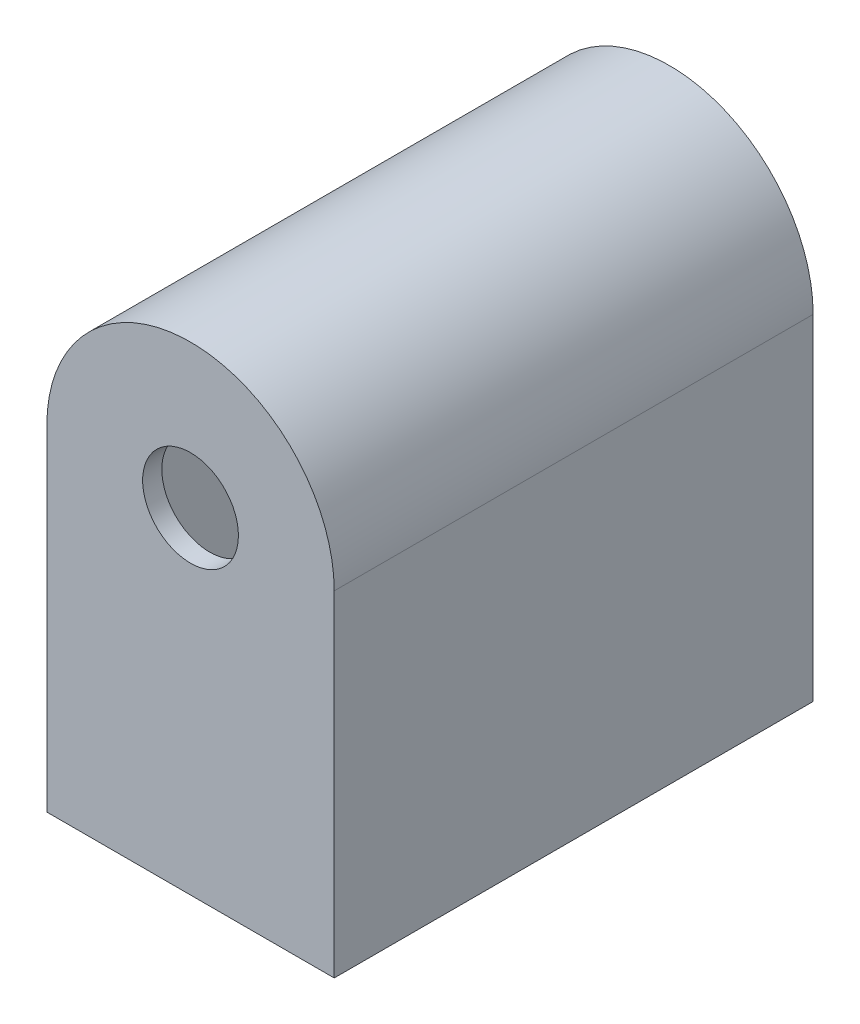
ISO-10303-21;
HEADER;
FILE_DESCRIPTION(('STEP AP214'),'2;1');
FILE_NAME('part.step','',(''),(''),'','','');
FILE_SCHEMA(('AUTOMOTIVE_DESIGN { 1 0 10303 214 1 1 1 1 }'));
ENDSEC;
DATA;
#1=APPLICATION_CONTEXT('core data for automotive mechanical design processes');
#2=APPLICATION_PROTOCOL_DEFINITION('international standard','automotive_design',2000,#1);
#3=PRODUCT_CONTEXT('',#1,'mechanical');
#4=PRODUCT('Part','Part','',(#3));
#5=PRODUCT_RELATED_PRODUCT_CATEGORY('part','',(#4));
#6=PRODUCT_DEFINITION_FORMATION('','',#4);
#7=PRODUCT_DEFINITION_CONTEXT('part definition',#1,'design');
#8=PRODUCT_DEFINITION('design','',#6,#7);
#9=PRODUCT_DEFINITION_SHAPE('','',#8);
#10=(LENGTH_UNIT() NAMED_UNIT(*) SI_UNIT(.MILLI.,.METRE.));
#11=(NAMED_UNIT(*) PLANE_ANGLE_UNIT() SI_UNIT($,.RADIAN.));
#12=(NAMED_UNIT(*) SI_UNIT($,.STERADIAN.) SOLID_ANGLE_UNIT());
#13=UNCERTAINTY_MEASURE_WITH_UNIT(LENGTH_MEASURE(1.E-05),#10,'distance_accuracy_value','');
#14=(GEOMETRIC_REPRESENTATION_CONTEXT(3) GLOBAL_UNCERTAINTY_ASSIGNED_CONTEXT((#13)) GLOBAL_UNIT_ASSIGNED_CONTEXT((#10,
#11,#12)) REPRESENTATION_CONTEXT('',''));
#15=CARTESIAN_POINT('',(0.,0.,0.));
#16=DIRECTION('',(0.,0.,1.));
#17=DIRECTION('',(1.,0.,0.));
#18=AXIS2_PLACEMENT_3D('',#15,#16,#17);
#19=CARTESIAN_POINT('',(0.,17.5,-50.));
#20=DIRECTION('',(0.,0.,1.));
#21=DIRECTION('',(1.,0.,0.));
#22=AXIS2_PLACEMENT_3D('',#19,#20,#21);
#23=CYLINDRICAL_SURFACE('',#22,15.);
#24=CARTESIAN_POINT('',(0.,17.5,0.));
#25=DIRECTION('',(0.,0.,1.));
#26=DIRECTION('',(1.,0.,0.));
#27=AXIS2_PLACEMENT_3D('',#24,#25,#26);
#28=CIRCLE('',#27,15.);
#29=CARTESIAN_POINT('',(15.,17.5,0.));
#30=VERTEX_POINT('',#29);
#31=CARTESIAN_POINT('',(-15.,17.5,0.));
#32=VERTEX_POINT('',#31);
#33=EDGE_CURVE('E166',#30,#32,#28,.T.);
#34=ORIENTED_EDGE('',*,*,#33,.F.);
#35=DIRECTION('',(0.,0.,1.));
#36=VECTOR('',#35,1.);
#37=CARTESIAN_POINT('',(15.,17.5,-50.));
#38=LINE('',#37,#36);
#39=CARTESIAN_POINT('',(15.,17.5,-50.));
#40=VERTEX_POINT('',#39);
#41=EDGE_CURVE('E14',#40,#30,#38,.T.);
#42=ORIENTED_EDGE('',*,*,#41,.F.);
#43=CARTESIAN_POINT('',(0.,17.5,-50.));
#44=DIRECTION('',(0.,0.,1.));
#45=DIRECTION('',(1.,0.,0.));
#46=AXIS2_PLACEMENT_3D('',#43,#44,#45);
#47=CIRCLE('',#46,15.);
#48=CARTESIAN_POINT('',(-15.,17.5,-50.));
#49=VERTEX_POINT('',#48);
#50=EDGE_CURVE('E167',#40,#49,#47,.T.);
#51=ORIENTED_EDGE('',*,*,#50,.T.);
#52=DIRECTION('',(0.,0.,1.));
#53=VECTOR('',#52,1.);
#54=CARTESIAN_POINT('',(-15.,17.5,-50.));
#55=LINE('',#54,#53);
#56=EDGE_CURVE('E100',#49,#32,#55,.T.);
#57=ORIENTED_EDGE('',*,*,#56,.T.);
#58=EDGE_LOOP('',(#34,#42,#51,#57));
#59=FACE_BOUND('',#58,.T.);
#60=ADVANCED_FACE('F51',(#59),#23,.T.);
#61=CARTESIAN_POINT('',(15.,-17.5,-50.));
#62=DIRECTION('',(1.,0.,0.));
#63=DIRECTION('',(0.,0.,-1.));
#64=AXIS2_PLACEMENT_3D('',#61,#62,#63);
#65=PLANE('',#64);
#66=DIRECTION('',(0.,1.,0.));
#67=VECTOR('',#66,1.);
#68=CARTESIAN_POINT('',(15.,-17.5,0.));
#69=LINE('',#68,#67);
#70=CARTESIAN_POINT('',(15.,-17.5,0.));
#71=VERTEX_POINT('',#70);
#72=EDGE_CURVE('E170',#71,#30,#69,.T.);
#73=ORIENTED_EDGE('',*,*,#72,.F.);
#74=DIRECTION('',(0.,0.,1.));
#75=VECTOR('',#74,1.);
#76=CARTESIAN_POINT('',(15.,-17.5,-50.));
#77=LINE('',#76,#75);
#78=CARTESIAN_POINT('',(15.,-17.5,-50.));
#79=VERTEX_POINT('',#78);
#80=EDGE_CURVE('E59',#79,#71,#77,.T.);
#81=ORIENTED_EDGE('',*,*,#80,.F.);
#82=DIRECTION('',(0.,1.,0.));
#83=VECTOR('',#82,1.);
#84=CARTESIAN_POINT('',(15.,-17.5,-50.));
#85=LINE('',#84,#83);
#86=EDGE_CURVE('E175',#79,#40,#85,.T.);
#87=ORIENTED_EDGE('',*,*,#86,.T.);
#88=ORIENTED_EDGE('',*,*,#41,.T.);
#89=EDGE_LOOP('',(#73,#81,#87,#88));
#90=FACE_BOUND('',#89,.T.);
#91=ADVANCED_FACE('F193',(#90),#65,.T.);
#92=CARTESIAN_POINT('',(-15.,-17.5,-50.));
#93=DIRECTION('',(0.,-1.,0.));
#94=DIRECTION('',(0.,0.,-1.));
#95=AXIS2_PLACEMENT_3D('',#92,#93,#94);
#96=PLANE('',#95);
#97=DIRECTION('',(1.,0.,0.));
#98=VECTOR('',#97,1.);
#99=CARTESIAN_POINT('',(-15.,-17.5,0.));
#100=LINE('',#99,#98);
#101=CARTESIAN_POINT('',(-15.,-17.5,0.));
#102=VERTEX_POINT('',#101);
#103=EDGE_CURVE('E182',#102,#71,#100,.T.);
#104=ORIENTED_EDGE('',*,*,#103,.F.);
#105=DIRECTION('',(0.,0.,1.));
#106=VECTOR('',#105,1.);
#107=CARTESIAN_POINT('',(-15.,-17.5,-50.));
#108=LINE('',#107,#106);
#109=CARTESIAN_POINT('',(-15.,-17.5,-50.));
#110=VERTEX_POINT('',#109);
#111=EDGE_CURVE('E188',#110,#102,#108,.T.);
#112=ORIENTED_EDGE('',*,*,#111,.F.);
#113=DIRECTION('',(1.,0.,0.));
#114=VECTOR('',#113,1.);
#115=CARTESIAN_POINT('',(-15.,-17.5,-50.));
#116=LINE('',#115,#114);
#117=EDGE_CURVE('E172',#110,#79,#116,.T.);
#118=ORIENTED_EDGE('',*,*,#117,.T.);
#119=ORIENTED_EDGE('',*,*,#80,.T.);
#120=EDGE_LOOP('',(#104,#112,#118,#119));
#121=FACE_BOUND('',#120,.T.);
#122=ADVANCED_FACE('F197',(#121),#96,.T.);
#123=CARTESIAN_POINT('',(-15.,-17.5,-50.));
#124=DIRECTION('',(-1.,0.,0.));
#125=DIRECTION('',(0.,0.,1.));
#126=AXIS2_PLACEMENT_3D('',#123,#124,#125);
#127=PLANE('',#126);
#128=DIRECTION('',(0.,-1.,0.));
#129=VECTOR('',#128,1.);
#130=CARTESIAN_POINT('',(-15.,-17.5,0.));
#131=LINE('',#130,#129);
#132=EDGE_CURVE('E179',#32,#102,#131,.T.);
#133=ORIENTED_EDGE('',*,*,#132,.F.);
#134=ORIENTED_EDGE('',*,*,#56,.F.);
#135=DIRECTION('',(0.,-1.,0.));
#136=VECTOR('',#135,1.);
#137=CARTESIAN_POINT('',(-15.,-17.5,-50.));
#138=LINE('',#137,#136);
#139=EDGE_CURVE('E169',#49,#110,#138,.T.);
#140=ORIENTED_EDGE('',*,*,#139,.T.);
#141=ORIENTED_EDGE('',*,*,#111,.T.);
#142=EDGE_LOOP('',(#133,#134,#140,#141));
#143=FACE_BOUND('',#142,.T.);
#144=ADVANCED_FACE('F189',(#143),#127,.T.);
#145=CARTESIAN_POINT('',(0.,17.5,-50.));
#146=DIRECTION('',(0.,0.,1.));
#147=DIRECTION('',(1.,0.,0.));
#148=AXIS2_PLACEMENT_3D('',#145,#146,#147);
#149=PLANE('',#148);
#150=DIRECTION('',(-1.,0.,0.));
#151=VECTOR('',#150,1.);
#152=CARTESIAN_POINT('',(13.,-15.5,-50.));
#153=LINE('',#152,#151);
#154=CARTESIAN_POINT('',(13.,-15.5,-50.));
#155=VERTEX_POINT('',#154);
#156=CARTESIAN_POINT('',(-13.,-15.5,-50.));
#157=VERTEX_POINT('',#156);
#158=EDGE_CURVE('E149',#155,#157,#153,.T.);
#159=ORIENTED_EDGE('',*,*,#158,.F.);
#160=DIRECTION('',(0.,-1.,0.));
#161=VECTOR('',#160,1.);
#162=CARTESIAN_POINT('',(13.,17.5,-50.));
#163=LINE('',#162,#161);
#164=CARTESIAN_POINT('',(13.,17.5,-50.));
#165=VERTEX_POINT('',#164);
#166=EDGE_CURVE('E141',#165,#155,#163,.T.);
#167=ORIENTED_EDGE('',*,*,#166,.F.);
#168=CARTESIAN_POINT('',(0.,17.5,-50.));
#169=DIRECTION('',(0.,0.,-1.));
#170=DIRECTION('',(-1.,0.,0.));
#171=AXIS2_PLACEMENT_3D('',#168,#169,#170);
#172=CIRCLE('',#171,13.);
#173=CARTESIAN_POINT('',(-13.,17.5,-50.));
#174=VERTEX_POINT('',#173);
#175=EDGE_CURVE('E153',#174,#165,#172,.T.);
#176=ORIENTED_EDGE('',*,*,#175,.F.);
#177=DIRECTION('',(0.,1.,0.));
#178=VECTOR('',#177,1.);
#179=CARTESIAN_POINT('',(-13.,-15.5,-50.));
#180=LINE('',#179,#178);
#181=EDGE_CURVE('E67',#157,#174,#180,.T.);
#182=ORIENTED_EDGE('',*,*,#181,.F.);
#183=EDGE_LOOP('',(#159,#167,#176,#182));
#184=FACE_BOUND('',#183,.T.);
#185=ORIENTED_EDGE('',*,*,#50,.F.);
#186=ORIENTED_EDGE('',*,*,#86,.F.);
#187=ORIENTED_EDGE('',*,*,#117,.F.);
#188=ORIENTED_EDGE('',*,*,#139,.F.);
#189=EDGE_LOOP('',(#185,#186,#187,#188));
#190=FACE_BOUND('',#189,.T.);
#191=ADVANCED_FACE('F199',(#184,#190),#149,.F.);
#192=CARTESIAN_POINT('',(0.,17.5,0.));
#193=DIRECTION('',(0.,0.,1.));
#194=DIRECTION('',(1.,0.,0.));
#195=AXIS2_PLACEMENT_3D('',#192,#193,#194);
#196=PLANE('',#195);
#197=CARTESIAN_POINT('',(0.,17.5,0.));
#198=DIRECTION('',(0.,0.,1.));
#199=DIRECTION('',(1.,0.,0.));
#200=AXIS2_PLACEMENT_3D('',#197,#198,#199);
#201=CIRCLE('',#200,5.);
#202=CARTESIAN_POINT('',(5.,17.5,0.));
#203=VERTEX_POINT('',#202);
#204=EDGE_CURVE('E163',#203,#203,#201,.T.);
#205=ORIENTED_EDGE('',*,*,#204,.F.);
#206=EDGE_LOOP('',(#205));
#207=FACE_BOUND('',#206,.T.);
#208=ORIENTED_EDGE('',*,*,#33,.T.);
#209=ORIENTED_EDGE('',*,*,#132,.T.);
#210=ORIENTED_EDGE('',*,*,#103,.T.);
#211=ORIENTED_EDGE('',*,*,#72,.T.);
#212=EDGE_LOOP('',(#208,#209,#210,#211));
#213=FACE_BOUND('',#212,.T.);
#214=ADVANCED_FACE('F192',(#207,#213),#196,.T.);
#215=CARTESIAN_POINT('',(0.,17.5,-50.));
#216=DIRECTION('',(0.,0.,1.));
#217=DIRECTION('',(1.,0.,0.));
#218=AXIS2_PLACEMENT_3D('',#215,#216,#217);
#219=CYLINDRICAL_SURFACE('',#218,5.);
#220=CARTESIAN_POINT('',(0.,17.5,-2.));
#221=DIRECTION('',(0.,0.,1.));
#222=DIRECTION('',(1.,0.,0.));
#223=AXIS2_PLACEMENT_3D('',#220,#221,#222);
#224=CIRCLE('',#223,5.);
#225=CARTESIAN_POINT('',(5.,17.5,-2.));
#226=VERTEX_POINT('',#225);
#227=EDGE_CURVE('E54',#226,#226,#224,.F.);
#228=ORIENTED_EDGE('',*,*,#227,.T.);
#229=EDGE_LOOP('',(#228));
#230=FACE_BOUND('',#229,.T.);
#231=ORIENTED_EDGE('',*,*,#204,.T.);
#232=EDGE_LOOP('',(#231));
#233=FACE_BOUND('',#232,.T.);
#234=ADVANCED_FACE('F207',(#230,#233),#219,.F.);
#235=CARTESIAN_POINT('',(0.,17.5,-2.));
#236=DIRECTION('',(0.,0.,1.));
#237=DIRECTION('',(1.,0.,0.));
#238=AXIS2_PLACEMENT_3D('',#235,#236,#237);
#239=PLANE('',#238);
#240=CARTESIAN_POINT('',(0.,17.5,-2.));
#241=DIRECTION('',(0.,0.,1.));
#242=DIRECTION('',(1.,0.,0.));
#243=AXIS2_PLACEMENT_3D('',#240,#241,#242);
#244=CIRCLE('',#243,13.);
#245=CARTESIAN_POINT('',(-13.,17.5,-2.));
#246=VERTEX_POINT('',#245);
#247=CARTESIAN_POINT('',(13.,17.5,-2.));
#248=VERTEX_POINT('',#247);
#249=EDGE_CURVE('E146',#246,#248,#244,.F.);
#250=ORIENTED_EDGE('',*,*,#249,.T.);
#251=DIRECTION('',(0.,-1.,0.));
#252=VECTOR('',#251,1.);
#253=CARTESIAN_POINT('',(13.,17.5,-2.));
#254=LINE('',#253,#252);
#255=CARTESIAN_POINT('',(13.,-15.5,-2.));
#256=VERTEX_POINT('',#255);
#257=EDGE_CURVE('E138',#248,#256,#254,.T.);
#258=ORIENTED_EDGE('',*,*,#257,.T.);
#259=DIRECTION('',(-1.,0.,0.));
#260=VECTOR('',#259,1.);
#261=CARTESIAN_POINT('',(13.,-15.5,-2.));
#262=LINE('',#261,#260);
#263=CARTESIAN_POINT('',(-13.,-15.5,-2.));
#264=VERTEX_POINT('',#263);
#265=EDGE_CURVE('E125',#256,#264,#262,.T.);
#266=ORIENTED_EDGE('',*,*,#265,.T.);
#267=DIRECTION('',(0.,1.,0.));
#268=VECTOR('',#267,1.);
#269=CARTESIAN_POINT('',(-13.,-15.5,-2.));
#270=LINE('',#269,#268);
#271=EDGE_CURVE('E158',#264,#246,#270,.T.);
#272=ORIENTED_EDGE('',*,*,#271,.T.);
#273=EDGE_LOOP('',(#250,#258,#266,#272));
#274=FACE_BOUND('',#273,.T.);
#275=ORIENTED_EDGE('',*,*,#227,.F.);
#276=EDGE_LOOP('',(#275));
#277=FACE_BOUND('',#276,.T.);
#278=ADVANCED_FACE('F144',(#274,#277),#239,.F.);
#279=CARTESIAN_POINT('',(13.,17.5,52.8393792544916));
#280=DIRECTION('',(1.,0.,0.));
#281=DIRECTION('',(0.,0.,-1.));
#282=AXIS2_PLACEMENT_3D('',#279,#280,#281);
#283=PLANE('',#282);
#284=DIRECTION('',(0.,0.,-1.));
#285=VECTOR('',#284,1.);
#286=CARTESIAN_POINT('',(13.,17.5,52.8393792544916));
#287=LINE('',#286,#285);
#288=EDGE_CURVE('E156',#248,#165,#287,.T.);
#289=ORIENTED_EDGE('',*,*,#288,.T.);
#290=ORIENTED_EDGE('',*,*,#166,.T.);
#291=DIRECTION('',(0.,0.,-1.));
#292=VECTOR('',#291,1.);
#293=CARTESIAN_POINT('',(13.,-15.5,52.8393792544916));
#294=LINE('',#293,#292);
#295=EDGE_CURVE('E129',#256,#155,#294,.T.);
#296=ORIENTED_EDGE('',*,*,#295,.F.);
#297=ORIENTED_EDGE('',*,*,#257,.F.);
#298=EDGE_LOOP('',(#289,#290,#296,#297));
#299=FACE_BOUND('',#298,.T.);
#300=ADVANCED_FACE('F137',(#299),#283,.F.);
#301=CARTESIAN_POINT('',(13.,-15.5,52.8393792544916));
#302=DIRECTION('',(0.,-1.,0.));
#303=DIRECTION('',(0.,0.,-1.));
#304=AXIS2_PLACEMENT_3D('',#301,#302,#303);
#305=PLANE('',#304);
#306=ORIENTED_EDGE('',*,*,#295,.T.);
#307=ORIENTED_EDGE('',*,*,#158,.T.);
#308=DIRECTION('',(0.,0.,-1.));
#309=VECTOR('',#308,1.);
#310=CARTESIAN_POINT('',(-13.,-15.5,52.8393792544916));
#311=LINE('',#310,#309);
#312=EDGE_CURVE('E131',#264,#157,#311,.T.);
#313=ORIENTED_EDGE('',*,*,#312,.F.);
#314=ORIENTED_EDGE('',*,*,#265,.F.);
#315=EDGE_LOOP('',(#306,#307,#313,#314));
#316=FACE_BOUND('',#315,.T.);
#317=ADVANCED_FACE('F127',(#316),#305,.F.);
#318=CARTESIAN_POINT('',(-13.,-15.5,52.8393792544916));
#319=DIRECTION('',(-1.,0.,0.));
#320=DIRECTION('',(0.,-1.,0.));
#321=AXIS2_PLACEMENT_3D('',#318,#319,#320);
#322=PLANE('',#321);
#323=ORIENTED_EDGE('',*,*,#312,.T.);
#324=ORIENTED_EDGE('',*,*,#181,.T.);
#325=DIRECTION('',(0.,0.,-1.));
#326=VECTOR('',#325,1.);
#327=CARTESIAN_POINT('',(-13.,17.5,52.8393792544916));
#328=LINE('',#327,#326);
#329=EDGE_CURVE('E157',#246,#174,#328,.T.);
#330=ORIENTED_EDGE('',*,*,#329,.F.);
#331=ORIENTED_EDGE('',*,*,#271,.F.);
#332=EDGE_LOOP('',(#323,#324,#330,#331));
#333=FACE_BOUND('',#332,.T.);
#334=ADVANCED_FACE('F269',(#333),#322,.F.);
#335=CARTESIAN_POINT('',(0.,17.5,52.8393792544916));
#336=DIRECTION('',(0.,0.,-1.));
#337=DIRECTION('',(-1.,0.,0.));
#338=AXIS2_PLACEMENT_3D('',#335,#336,#337);
#339=CYLINDRICAL_SURFACE('',#338,13.);
#340=ORIENTED_EDGE('',*,*,#329,.T.);
#341=ORIENTED_EDGE('',*,*,#175,.T.);
#342=ORIENTED_EDGE('',*,*,#288,.F.);
#343=ORIENTED_EDGE('',*,*,#249,.F.);
#344=EDGE_LOOP('',(#340,#341,#342,#343));
#345=FACE_BOUND('',#344,.T.);
#346=ADVANCED_FACE('F278',(#345),#339,.F.);
#347=CLOSED_SHELL('',(#60,#91,#122,#144,#191,#214,#234,#278,#300,#317,#334,#346));
#348=MANIFOLD_SOLID_BREP('B2',#347);
#349=ADVANCED_BREP_SHAPE_REPRESENTATION('',(#18,#348),#14);
#350=SHAPE_DEFINITION_REPRESENTATION(#9,#349);
ENDSEC;
END-ISO-10303-21;
